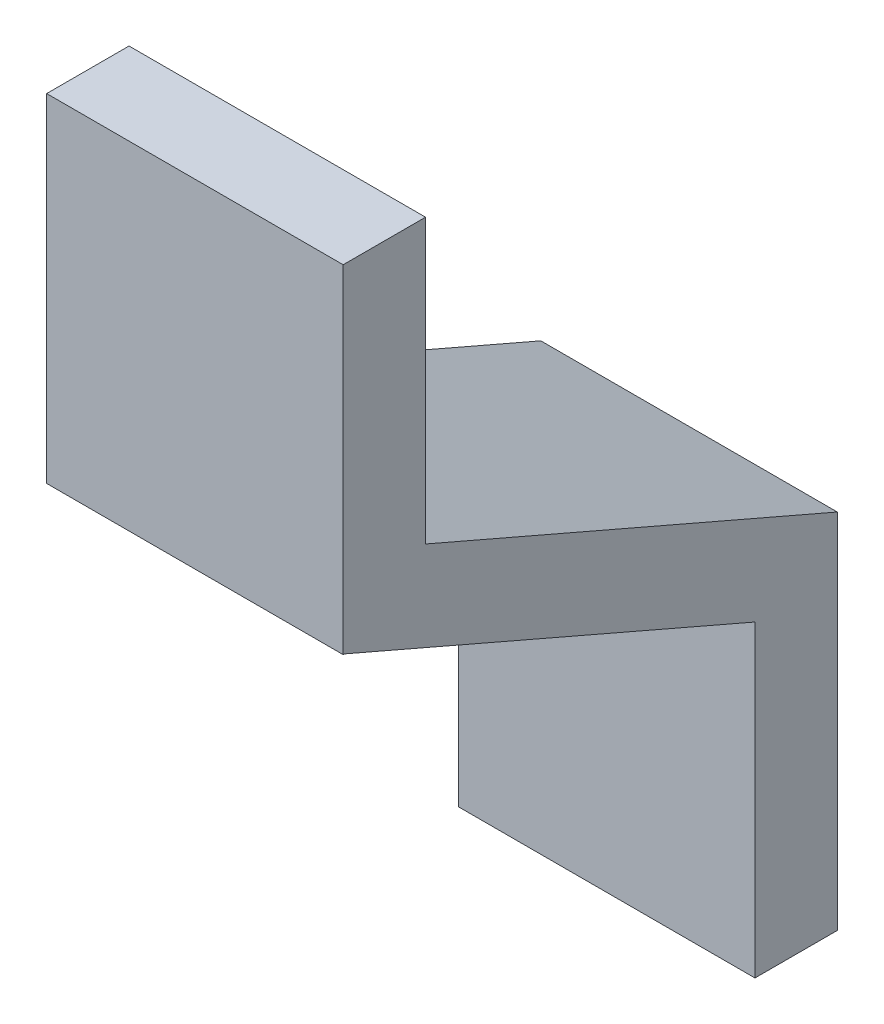
ISO-10303-21;
HEADER;
FILE_DESCRIPTION(('STEP AP214'),'2;1');
FILE_NAME('part.step','',(''),(''),'','','');
FILE_SCHEMA(('AUTOMOTIVE_DESIGN { 1 0 10303 214 1 1 1 1 }'));
ENDSEC;
DATA;
#1=APPLICATION_CONTEXT('core data for automotive mechanical design processes');
#2=APPLICATION_PROTOCOL_DEFINITION('international standard','automotive_design',2000,#1);
#3=PRODUCT_CONTEXT('',#1,'mechanical');
#4=PRODUCT('Part','Part','',(#3));
#5=PRODUCT_RELATED_PRODUCT_CATEGORY('part','',(#4));
#6=PRODUCT_DEFINITION_FORMATION('','',#4);
#7=PRODUCT_DEFINITION_CONTEXT('part definition',#1,'design');
#8=PRODUCT_DEFINITION('design','',#6,#7);
#9=PRODUCT_DEFINITION_SHAPE('','',#8);
#10=(LENGTH_UNIT() NAMED_UNIT(*) SI_UNIT(.MILLI.,.METRE.));
#11=(NAMED_UNIT(*) PLANE_ANGLE_UNIT() SI_UNIT($,.RADIAN.));
#12=(NAMED_UNIT(*) SI_UNIT($,.STERADIAN.) SOLID_ANGLE_UNIT());
#13=UNCERTAINTY_MEASURE_WITH_UNIT(LENGTH_MEASURE(1.E-05),#10,'distance_accuracy_value','');
#14=(GEOMETRIC_REPRESENTATION_CONTEXT(3) GLOBAL_UNCERTAINTY_ASSIGNED_CONTEXT((#13)) GLOBAL_UNIT_ASSIGNED_CONTEXT((#10,
#11,#12)) REPRESENTATION_CONTEXT('',''));
#15=CARTESIAN_POINT('',(0.,0.,0.));
#16=DIRECTION('',(0.,0.,1.));
#17=DIRECTION('',(1.,0.,0.));
#18=AXIS2_PLACEMENT_3D('',#15,#16,#17);
#19=CARTESIAN_POINT('',(4.22,0.999999996424,0.5));
#20=DIRECTION('',(0.,1.,0.));
#21=DIRECTION('',(0.,0.,1.));
#22=AXIS2_PLACEMENT_3D('',#19,#20,#21);
#23=PLANE('',#22);
#24=DIRECTION('',(1.,0.,0.));
#25=VECTOR('',#24,1.);
#26=CARTESIAN_POINT('',(4.22,0.999999996424,0.5));
#27=LINE('',#26,#25);
#28=CARTESIAN_POINT('',(4.580000014305,0.999999996424,0.5));
#29=VERTEX_POINT('',#28);
#30=CARTESIAN_POINT('',(4.22,0.999999996424,0.5));
#31=VERTEX_POINT('',#30);
#32=EDGE_CURVE('E140',#29,#31,#27,.F.);
#33=ORIENTED_EDGE('',*,*,#32,.T.);
#34=DIRECTION('',(0.,0.,-1.));
#35=VECTOR('',#34,1.);
#36=CARTESIAN_POINT('',(4.22,0.999999996424,0.));
#37=LINE('',#36,#35);
#38=CARTESIAN_POINT('',(4.22,0.999999996424,0.60000000149));
#39=VERTEX_POINT('',#38);
#40=EDGE_CURVE('E133',#31,#39,#37,.F.);
#41=ORIENTED_EDGE('',*,*,#40,.T.);
#42=DIRECTION('',(1.,0.,0.));
#43=VECTOR('',#42,1.);
#44=CARTESIAN_POINT('',(4.22,0.999999996424,0.60000000149));
#45=LINE('',#44,#43);
#46=CARTESIAN_POINT('',(4.580000014305,0.999999996424,0.60000000149));
#47=VERTEX_POINT('',#46);
#48=EDGE_CURVE('E129',#47,#39,#45,.F.);
#49=ORIENTED_EDGE('',*,*,#48,.F.);
#50=DIRECTION('',(0.,0.,-1.));
#51=VECTOR('',#50,1.);
#52=CARTESIAN_POINT('',(4.580000014305,0.999999996424,0.));
#53=LINE('',#52,#51);
#54=EDGE_CURVE('E106',#29,#47,#53,.F.);
#55=ORIENTED_EDGE('',*,*,#54,.F.);
#56=EDGE_LOOP('',(#33,#41,#49,#55));
#57=FACE_BOUND('',#56,.T.);
#58=ADVANCED_FACE('F17',(#57),#23,.T.);
#59=CARTESIAN_POINT('',(4.22,0.59,0.60000000149));
#60=DIRECTION('',(0.,0.,1.));
#61=DIRECTION('',(1.,0.,0.));
#62=AXIS2_PLACEMENT_3D('',#59,#60,#61);
#63=PLANE('',#62);
#64=DIRECTION('',(0.,1.,0.));
#65=VECTOR('',#64,1.);
#66=CARTESIAN_POINT('',(4.22,0.44,0.60000000149));
#67=LINE('',#66,#65);
#68=CARTESIAN_POINT('',(4.22,0.59,0.60000000149));
#69=VERTEX_POINT('',#68);
#70=EDGE_CURVE('E136',#39,#69,#67,.F.);
#71=ORIENTED_EDGE('',*,*,#70,.T.);
#72=DIRECTION('',(1.,0.,0.));
#73=VECTOR('',#72,1.);
#74=CARTESIAN_POINT('',(4.22,0.59,0.60000000149));
#75=LINE('',#74,#73);
#76=CARTESIAN_POINT('',(4.580000014305,0.59,0.60000000149));
#77=VERTEX_POINT('',#76);
#78=EDGE_CURVE('E92',#69,#77,#75,.T.);
#79=ORIENTED_EDGE('',*,*,#78,.T.);
#80=DIRECTION('',(0.,1.,0.));
#81=VECTOR('',#80,1.);
#82=CARTESIAN_POINT('',(4.580000014305,0.44,0.60000000149));
#83=LINE('',#82,#81);
#84=EDGE_CURVE('E73',#47,#77,#83,.F.);
#85=ORIENTED_EDGE('',*,*,#84,.F.);
#86=ORIENTED_EDGE('',*,*,#48,.T.);
#87=EDGE_LOOP('',(#71,#79,#85,#86));
#88=FACE_BOUND('',#87,.T.);
#89=ADVANCED_FACE('F285',(#88),#63,.T.);
#90=CARTESIAN_POINT('',(4.22,0.59,0.5));
#91=DIRECTION('',(0.,1.,0.));
#92=DIRECTION('',(0.,0.,1.));
#93=AXIS2_PLACEMENT_3D('',#90,#91,#92);
#94=PLANE('',#93);
#95=DIRECTION('',(1.,0.,0.));
#96=VECTOR('',#95,1.);
#97=CARTESIAN_POINT('',(4.22,0.590000000000416,0.59842599626982));
#98=LINE('',#97,#96);
#99=CARTESIAN_POINT('',(4.580000014305,0.590000000000104,0.598425996269911));
#100=VERTEX_POINT('',#99);
#101=CARTESIAN_POINT('',(4.22,0.590000000000104,0.59842599626991));
#102=VERTEX_POINT('',#101);
#103=EDGE_CURVE('E84',#100,#102,#98,.F.);
#104=ORIENTED_EDGE('',*,*,#103,.F.);
#105=DIRECTION('',(0.,0.,-1.));
#106=VECTOR('',#105,1.);
#107=CARTESIAN_POINT('',(4.580000014305,0.59,0.));
#108=LINE('',#107,#106);
#109=EDGE_CURVE('E20',#77,#100,#108,.T.);
#110=ORIENTED_EDGE('',*,*,#109,.F.);
#111=ORIENTED_EDGE('',*,*,#78,.F.);
#112=DIRECTION('',(0.,0.,1.));
#113=VECTOR('',#112,1.);
#114=CARTESIAN_POINT('',(4.22,0.59,0.5));
#115=LINE('',#114,#113);
#116=EDGE_CURVE('E87',#69,#102,#115,.F.);
#117=ORIENTED_EDGE('',*,*,#116,.T.);
#118=EDGE_LOOP('',(#104,#110,#111,#117));
#119=FACE_BOUND('',#118,.T.);
#120=ADVANCED_FACE('F85',(#119),#94,.F.);
#121=CARTESIAN_POINT('',(4.22,0.348224508223,0.03971472531736));
#122=DIRECTION('',(0.,-0.917754904098641,0.397147247255844));
#123=DIRECTION('',(0.,-0.397147247255844,-0.917754904098641));
#124=AXIS2_PLACEMENT_3D('',#121,#122,#123);
#125=PLANE('',#124);
#126=DIRECTION('',(0.,-0.397147247255413,-0.917754904098827));
#127=VECTOR('',#126,1.);
#128=CARTESIAN_POINT('',(4.580000014305,0.59,0.59842599627));
#129=LINE('',#128,#127);
#130=CARTESIAN_POINT('',(4.580000014305,0.37431222660502,0.10000000149));
#131=VERTEX_POINT('',#130);
#132=EDGE_CURVE('E80',#100,#131,#129,.T.);
#133=ORIENTED_EDGE('',*,*,#132,.F.);
#134=ORIENTED_EDGE('',*,*,#103,.T.);
#135=DIRECTION('',(0.,-0.397147247255413,-0.917754904098827));
#136=VECTOR('',#135,1.);
#137=CARTESIAN_POINT('',(4.22,0.59,0.59842599627));
#138=LINE('',#137,#136);
#139=CARTESIAN_POINT('',(4.22,0.374312226605,0.10000000149));
#140=VERTEX_POINT('',#139);
#141=EDGE_CURVE('E122',#102,#140,#138,.T.);
#142=ORIENTED_EDGE('',*,*,#141,.T.);
#143=DIRECTION('',(1.,0.,0.));
#144=VECTOR('',#143,1.);
#145=CARTESIAN_POINT('',(4.22,0.374312226605,0.10000000149));
#146=LINE('',#145,#144);
#147=EDGE_CURVE('E91',#131,#140,#146,.F.);
#148=ORIENTED_EDGE('',*,*,#147,.F.);
#149=EDGE_LOOP('',(#133,#134,#142,#148));
#150=FACE_BOUND('',#149,.T.);
#151=ADVANCED_FACE('F94',(#150),#125,.T.);
#152=CARTESIAN_POINT('',(4.22,0.,0.10000000149));
#153=DIRECTION('',(0.,0.,1.));
#154=DIRECTION('',(1.,0.,0.));
#155=AXIS2_PLACEMENT_3D('',#152,#153,#154);
#156=PLANE('',#155);
#157=ORIENTED_EDGE('',*,*,#147,.T.);
#158=DIRECTION('',(0.,1.,0.));
#159=VECTOR('',#158,1.);
#160=CARTESIAN_POINT('',(4.22,0.44,0.10000000149));
#161=LINE('',#160,#159);
#162=CARTESIAN_POINT('',(4.22,0.,0.10000000149));
#163=VERTEX_POINT('',#162);
#164=EDGE_CURVE('E118',#140,#163,#161,.F.);
#165=ORIENTED_EDGE('',*,*,#164,.T.);
#166=DIRECTION('',(1.,0.,0.));
#167=VECTOR('',#166,1.);
#168=CARTESIAN_POINT('',(4.22,0.,0.10000000149));
#169=LINE('',#168,#167);
#170=CARTESIAN_POINT('',(4.580000014305,0.,0.10000000149));
#171=VERTEX_POINT('',#170);
#172=EDGE_CURVE('E115',#163,#171,#169,.T.);
#173=ORIENTED_EDGE('',*,*,#172,.T.);
#174=DIRECTION('',(0.,1.,0.));
#175=VECTOR('',#174,1.);
#176=CARTESIAN_POINT('',(4.580000014305,0.44,0.10000000149));
#177=LINE('',#176,#175);
#178=EDGE_CURVE('E96',#131,#171,#177,.F.);
#179=ORIENTED_EDGE('',*,*,#178,.F.);
#180=EDGE_LOOP('',(#157,#165,#173,#179));
#181=FACE_BOUND('',#180,.T.);
#182=ADVANCED_FACE('F202',(#181),#156,.T.);
#183=CARTESIAN_POINT('',(4.22,0.,0.));
#184=DIRECTION('',(0.,1.,0.));
#185=DIRECTION('',(0.,0.,1.));
#186=AXIS2_PLACEMENT_3D('',#183,#184,#185);
#187=PLANE('',#186);
#188=DIRECTION('',(0.,0.,-1.));
#189=VECTOR('',#188,1.);
#190=CARTESIAN_POINT('',(4.22,0.,0.));
#191=LINE('',#190,#189);
#192=CARTESIAN_POINT('',(4.22,0.,0.));
#193=VERTEX_POINT('',#192);
#194=EDGE_CURVE('E121',#163,#193,#191,.T.);
#195=ORIENTED_EDGE('',*,*,#194,.T.);
#196=DIRECTION('',(1.,0.,0.));
#197=VECTOR('',#196,1.);
#198=CARTESIAN_POINT('',(4.22,0.,0.));
#199=LINE('',#198,#197);
#200=CARTESIAN_POINT('',(4.580000014305,0.,0.));
#201=VERTEX_POINT('',#200);
#202=EDGE_CURVE('E112',#193,#201,#199,.T.);
#203=ORIENTED_EDGE('',*,*,#202,.T.);
#204=DIRECTION('',(0.,0.,-1.));
#205=VECTOR('',#204,1.);
#206=CARTESIAN_POINT('',(4.580000014305,0.,0.));
#207=LINE('',#206,#205);
#208=EDGE_CURVE('E98',#171,#201,#207,.T.);
#209=ORIENTED_EDGE('',*,*,#208,.F.);
#210=ORIENTED_EDGE('',*,*,#172,.F.);
#211=EDGE_LOOP('',(#195,#203,#209,#210));
#212=FACE_BOUND('',#211,.T.);
#213=ADVANCED_FACE('F206',(#212),#187,.F.);
#214=CARTESIAN_POINT('',(4.22,0.,0.));
#215=DIRECTION('',(0.,0.,1.));
#216=DIRECTION('',(1.,0.,0.));
#217=AXIS2_PLACEMENT_3D('',#214,#215,#216);
#218=PLANE('',#217);
#219=ORIENTED_EDGE('',*,*,#202,.F.);
#220=DIRECTION('',(0.,1.,0.));
#221=VECTOR('',#220,1.);
#222=CARTESIAN_POINT('',(4.22,0.44,0.));
#223=LINE('',#222,#221);
#224=CARTESIAN_POINT('',(4.22,0.439999998997445,-1.94673175919965E-10));
#225=VERTEX_POINT('',#224);
#226=EDGE_CURVE('E178',#193,#225,#223,.T.);
#227=ORIENTED_EDGE('',*,*,#226,.T.);
#228=DIRECTION('',(1.,0.,0.));
#229=VECTOR('',#228,1.);
#230=CARTESIAN_POINT('',(4.22,0.43999999966303,-7.78692710220355E-10));
#231=LINE('',#230,#229);
#232=CARTESIAN_POINT('',(4.580000014305,0.439999998997445,-1.94673175919965E-10));
#233=VERTEX_POINT('',#232);
#234=EDGE_CURVE('E163',#225,#233,#231,.T.);
#235=ORIENTED_EDGE('',*,*,#234,.T.);
#236=DIRECTION('',(0.,1.,0.));
#237=VECTOR('',#236,1.);
#238=CARTESIAN_POINT('',(4.580000014305,0.44,0.));
#239=LINE('',#238,#237);
#240=EDGE_CURVE('E109',#201,#233,#239,.T.);
#241=ORIENTED_EDGE('',*,*,#240,.F.);
#242=EDGE_LOOP('',(#219,#227,#235,#241));
#243=FACE_BOUND('',#242,.T.);
#244=ADVANCED_FACE('F186',(#243),#218,.F.);
#245=CARTESIAN_POINT('',(4.580000014305,0.44,0.));
#246=DIRECTION('',(1.,0.,0.));
#247=DIRECTION('',(0.,0.,-1.));
#248=AXIS2_PLACEMENT_3D('',#245,#246,#247);
#249=PLANE('',#248);
#250=ORIENTED_EDGE('',*,*,#178,.T.);
#251=ORIENTED_EDGE('',*,*,#208,.T.);
#252=ORIENTED_EDGE('',*,*,#240,.T.);
#253=DIRECTION('',(0.,-0.397147247255844,-0.917754904098641));
#254=VECTOR('',#253,1.);
#255=CARTESIAN_POINT('',(4.580000014305,0.44,0.));
#256=LINE('',#255,#254);
#257=CARTESIAN_POINT('',(4.580000014305,0.656368904967003,0.499999999999999));
#258=VERTEX_POINT('',#257);
#259=EDGE_CURVE('E151',#233,#258,#256,.F.);
#260=ORIENTED_EDGE('',*,*,#259,.T.);
#261=DIRECTION('',(0.,1.,0.));
#262=VECTOR('',#261,1.);
#263=CARTESIAN_POINT('',(4.580000014305,0.59,0.5));
#264=LINE('',#263,#262);
#265=EDGE_CURVE('E144',#258,#29,#264,.T.);
#266=ORIENTED_EDGE('',*,*,#265,.T.);
#267=ORIENTED_EDGE('',*,*,#54,.T.);
#268=ORIENTED_EDGE('',*,*,#84,.T.);
#269=ORIENTED_EDGE('',*,*,#109,.T.);
#270=ORIENTED_EDGE('',*,*,#132,.T.);
#271=EDGE_LOOP('',(#250,#251,#252,#260,#266,#267,#268,#269,#270));
#272=FACE_BOUND('',#271,.T.);
#273=ADVANCED_FACE('F78',(#272),#249,.T.);
#274=CARTESIAN_POINT('',(4.22,0.59,0.5));
#275=DIRECTION('',(0.,0.,1.));
#276=DIRECTION('',(1.,0.,0.));
#277=AXIS2_PLACEMENT_3D('',#274,#275,#276);
#278=PLANE('',#277);
#279=ORIENTED_EDGE('',*,*,#265,.F.);
#280=DIRECTION('',(1.,0.,0.));
#281=VECTOR('',#280,1.);
#282=CARTESIAN_POINT('',(4.22,0.656368904967005,0.499999999999998));
#283=LINE('',#282,#281);
#284=CARTESIAN_POINT('',(4.22,0.656368904967001,0.5));
#285=VERTEX_POINT('',#284);
#286=EDGE_CURVE('E26',#258,#285,#283,.F.);
#287=ORIENTED_EDGE('',*,*,#286,.T.);
#288=DIRECTION('',(0.,1.,0.));
#289=VECTOR('',#288,1.);
#290=CARTESIAN_POINT('',(4.22,0.44,0.5));
#291=LINE('',#290,#289);
#292=EDGE_CURVE('E34',#285,#31,#291,.T.);
#293=ORIENTED_EDGE('',*,*,#292,.T.);
#294=ORIENTED_EDGE('',*,*,#32,.F.);
#295=EDGE_LOOP('',(#279,#287,#293,#294));
#296=FACE_BOUND('',#295,.T.);
#297=ADVANCED_FACE('F212',(#296),#278,.F.);
#298=CARTESIAN_POINT('',(4.22,0.44,0.));
#299=DIRECTION('',(1.,0.,0.));
#300=DIRECTION('',(0.,0.,-1.));
#301=AXIS2_PLACEMENT_3D('',#298,#299,#300);
#302=PLANE('',#301);
#303=ORIENTED_EDGE('',*,*,#226,.F.);
#304=ORIENTED_EDGE('',*,*,#194,.F.);
#305=ORIENTED_EDGE('',*,*,#164,.F.);
#306=ORIENTED_EDGE('',*,*,#141,.F.);
#307=ORIENTED_EDGE('',*,*,#116,.F.);
#308=ORIENTED_EDGE('',*,*,#70,.F.);
#309=ORIENTED_EDGE('',*,*,#40,.F.);
#310=ORIENTED_EDGE('',*,*,#292,.F.);
#311=DIRECTION('',(0.,-0.397147247255844,-0.917754904098641));
#312=VECTOR('',#311,1.);
#313=CARTESIAN_POINT('',(4.22,0.44,0.));
#314=LINE('',#313,#312);
#315=EDGE_CURVE('E11',#285,#225,#314,.T.);
#316=ORIENTED_EDGE('',*,*,#315,.T.);
#317=EDGE_LOOP('',(#303,#304,#305,#306,#307,#308,#309,#310,#316));
#318=FACE_BOUND('',#317,.T.);
#319=ADVANCED_FACE('F207',(#318),#302,.F.);
#320=CARTESIAN_POINT('',(4.22,0.44,0.));
#321=DIRECTION('',(0.,-0.917754904098641,0.397147247255844));
#322=DIRECTION('',(0.,-0.397147247255844,-0.917754904098641));
#323=AXIS2_PLACEMENT_3D('',#320,#321,#322);
#324=PLANE('',#323);
#325=ORIENTED_EDGE('',*,*,#286,.F.);
#326=ORIENTED_EDGE('',*,*,#259,.F.);
#327=ORIENTED_EDGE('',*,*,#234,.F.);
#328=ORIENTED_EDGE('',*,*,#315,.F.);
#329=EDGE_LOOP('',(#325,#326,#327,#328));
#330=FACE_BOUND('',#329,.T.);
#331=ADVANCED_FACE('F193',(#330),#324,.F.);
#332=CLOSED_SHELL('',(#58,#89,#120,#151,#182,#213,#244,#273,#297,#319,#331));
#333=MANIFOLD_SOLID_BREP('B1',#332);
#334=ADVANCED_BREP_SHAPE_REPRESENTATION('',(#18,#333),#14);
#335=SHAPE_DEFINITION_REPRESENTATION(#9,#334);
ENDSEC;
END-ISO-10303-21;
